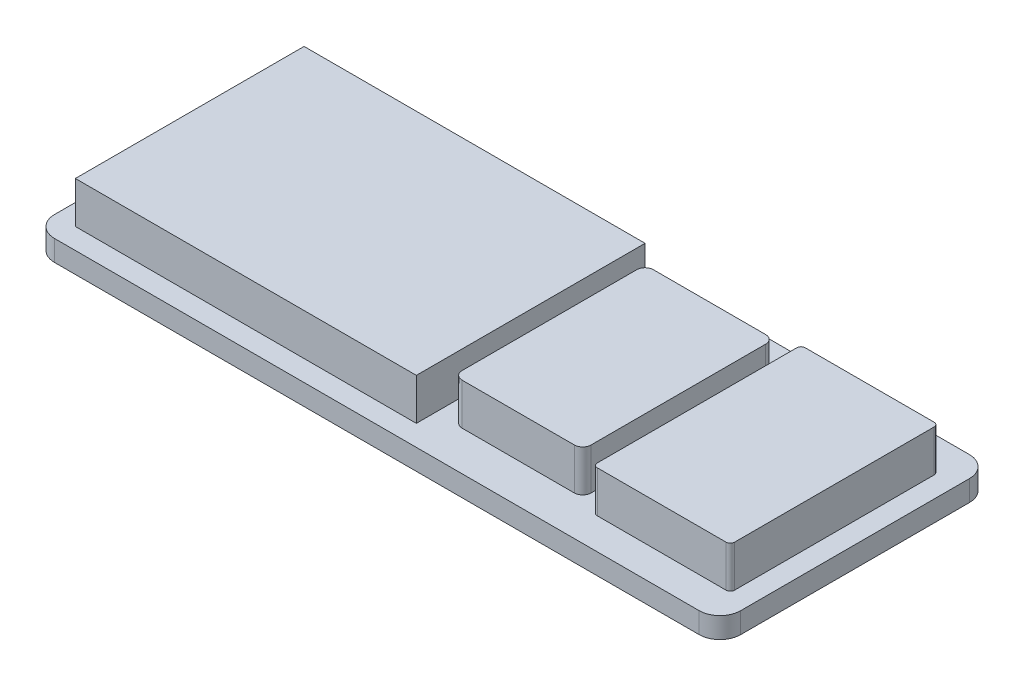
ISO-10303-21;
HEADER;
FILE_DESCRIPTION(('STEP AP214'),'2;1');
FILE_NAME('part.step','',(''),(''),'','','');
FILE_SCHEMA(('AUTOMOTIVE_DESIGN { 1 0 10303 214 1 1 1 1 }'));
ENDSEC;
DATA;
#1=APPLICATION_CONTEXT('core data for automotive mechanical design processes');
#2=APPLICATION_PROTOCOL_DEFINITION('international standard','automotive_design',2000,#1);
#3=PRODUCT_CONTEXT('',#1,'mechanical');
#4=PRODUCT('Part','Part','',(#3));
#5=PRODUCT_RELATED_PRODUCT_CATEGORY('part','',(#4));
#6=PRODUCT_DEFINITION_FORMATION('','',#4);
#7=PRODUCT_DEFINITION_CONTEXT('part definition',#1,'design');
#8=PRODUCT_DEFINITION('design','',#6,#7);
#9=PRODUCT_DEFINITION_SHAPE('','',#8);
#10=(LENGTH_UNIT() NAMED_UNIT(*) SI_UNIT(.MILLI.,.METRE.));
#11=(NAMED_UNIT(*) PLANE_ANGLE_UNIT() SI_UNIT($,.RADIAN.));
#12=(NAMED_UNIT(*) SI_UNIT($,.STERADIAN.) SOLID_ANGLE_UNIT());
#13=UNCERTAINTY_MEASURE_WITH_UNIT(LENGTH_MEASURE(1.E-05),#10,'distance_accuracy_value','');
#14=(GEOMETRIC_REPRESENTATION_CONTEXT(3) GLOBAL_UNCERTAINTY_ASSIGNED_CONTEXT((#13)) GLOBAL_UNIT_ASSIGNED_CONTEXT((#10,
#11,#12)) REPRESENTATION_CONTEXT('',''));
#15=CARTESIAN_POINT('',(0.,0.,0.));
#16=DIRECTION('',(0.,0.,1.));
#17=DIRECTION('',(1.,0.,0.));
#18=AXIS2_PLACEMENT_3D('',#15,#16,#17);
#19=CARTESIAN_POINT('',(0.,5.,0.));
#20=DIRECTION('',(0.,1.,0.));
#21=DIRECTION('',(0.,0.,1.));
#22=AXIS2_PLACEMENT_3D('',#19,#20,#21);
#23=PLANE('',#22);
#24=DIRECTION('',(1.,0.,0.));
#25=VECTOR('',#24,1.);
#26=CARTESIAN_POINT('',(26.4749340912451,5.,23.));
#27=LINE('',#26,#25);
#28=CARTESIAN_POINT('',(28.4749340912451,5.,23.));
#29=VERTEX_POINT('',#28);
#30=CARTESIAN_POINT('',(55.4749340912451,5.,23.));
#31=VERTEX_POINT('',#30);
#32=EDGE_CURVE('E403',#29,#31,#27,.T.);
#33=ORIENTED_EDGE('',*,*,#32,.F.);
#34=CARTESIAN_POINT('',(28.4749340912451,5.,21.));
#35=DIRECTION('',(0.,1.,0.));
#36=DIRECTION('',(0.,0.,1.));
#37=AXIS2_PLACEMENT_3D('',#34,#35,#36);
#38=CIRCLE('',#37,2.);
#39=CARTESIAN_POINT('',(26.4749340912451,5.,21.));
#40=VERTEX_POINT('',#39);
#41=EDGE_CURVE('E341',#29,#40,#38,.F.);
#42=ORIENTED_EDGE('',*,*,#41,.T.);
#43=DIRECTION('',(0.,0.,1.));
#44=VECTOR('',#43,1.);
#45=CARTESIAN_POINT('',(26.474934091245,5.,-23.));
#46=LINE('',#45,#44);
#47=CARTESIAN_POINT('',(26.474934091245,5.,-21.));
#48=VERTEX_POINT('',#47);
#49=EDGE_CURVE('E400',#48,#40,#46,.T.);
#50=ORIENTED_EDGE('',*,*,#49,.F.);
#51=CARTESIAN_POINT('',(28.474934091245,5.,-21.));
#52=DIRECTION('',(0.,1.,0.));
#53=DIRECTION('',(0.,0.,1.));
#54=AXIS2_PLACEMENT_3D('',#51,#52,#53);
#55=CIRCLE('',#54,2.);
#56=CARTESIAN_POINT('',(28.474934091245,5.,-23.));
#57=VERTEX_POINT('',#56);
#58=EDGE_CURVE('E335',#48,#57,#55,.F.);
#59=ORIENTED_EDGE('',*,*,#58,.T.);
#60=DIRECTION('',(-1.,0.,0.));
#61=VECTOR('',#60,1.);
#62=CARTESIAN_POINT('',(26.474934091245,5.,-23.));
#63=LINE('',#62,#61);
#64=CARTESIAN_POINT('',(55.474934091245,5.,-23.));
#65=VERTEX_POINT('',#64);
#66=EDGE_CURVE('E419',#65,#57,#63,.T.);
#67=ORIENTED_EDGE('',*,*,#66,.F.);
#68=CARTESIAN_POINT('',(55.474934091245,5.,-21.));
#69=DIRECTION('',(0.,1.,0.));
#70=DIRECTION('',(0.,0.,1.));
#71=AXIS2_PLACEMENT_3D('',#68,#69,#70);
#72=CIRCLE('',#71,2.);
#73=CARTESIAN_POINT('',(57.474934091245,5.,-21.));
#74=VERTEX_POINT('',#73);
#75=EDGE_CURVE('E337',#65,#74,#72,.F.);
#76=ORIENTED_EDGE('',*,*,#75,.T.);
#77=DIRECTION('',(0.,0.,-1.));
#78=VECTOR('',#77,1.);
#79=CARTESIAN_POINT('',(57.474934091245,5.,-23.));
#80=LINE('',#79,#78);
#81=CARTESIAN_POINT('',(57.4749340912451,5.,21.));
#82=VERTEX_POINT('',#81);
#83=EDGE_CURVE('E430',#82,#74,#80,.T.);
#84=ORIENTED_EDGE('',*,*,#83,.F.);
#85=CARTESIAN_POINT('',(55.4749340912451,5.,21.));
#86=DIRECTION('',(0.,1.,0.));
#87=DIRECTION('',(0.,0.,1.));
#88=AXIS2_PLACEMENT_3D('',#85,#86,#87);
#89=CIRCLE('',#88,2.);
#90=EDGE_CURVE('E339',#82,#31,#89,.F.);
#91=ORIENTED_EDGE('',*,*,#90,.T.);
#92=EDGE_LOOP('',(#33,#42,#50,#59,#67,#76,#84,#91));
#93=FACE_BOUND('',#92,.T.);
#94=DIRECTION('',(-1.,0.,0.));
#95=VECTOR('',#94,1.);
#96=CARTESIAN_POINT('',(-65.025065908755,5.,-32.5));
#97=LINE('',#96,#95);
#98=CARTESIAN_POINT('',(94.974934091245,5.,-32.5));
#99=VERTEX_POINT('',#98);
#100=CARTESIAN_POINT('',(-60.025065908755,5.,-32.5));
#101=VERTEX_POINT('',#100);
#102=EDGE_CURVE('E261',#99,#101,#97,.T.);
#103=ORIENTED_EDGE('',*,*,#102,.T.);
#104=CARTESIAN_POINT('',(-60.025065908755,5.,-27.5));
#105=DIRECTION('',(0.,1.,0.));
#106=DIRECTION('',(0.,0.,1.));
#107=AXIS2_PLACEMENT_3D('',#104,#105,#106);
#108=CIRCLE('',#107,5.);
#109=CARTESIAN_POINT('',(-65.025065908755,5.,-27.5));
#110=VERTEX_POINT('',#109);
#111=EDGE_CURVE('E295',#101,#110,#108,.T.);
#112=ORIENTED_EDGE('',*,*,#111,.T.);
#113=DIRECTION('',(0.,0.,1.));
#114=VECTOR('',#113,1.);
#115=CARTESIAN_POINT('',(-65.025065908755,5.,-32.5));
#116=LINE('',#115,#114);
#117=CARTESIAN_POINT('',(-65.0250659087549,5.,27.5));
#118=VERTEX_POINT('',#117);
#119=EDGE_CURVE('E251',#110,#118,#116,.T.);
#120=ORIENTED_EDGE('',*,*,#119,.T.);
#121=CARTESIAN_POINT('',(-60.0250659087549,5.,27.5));
#122=DIRECTION('',(0.,1.,0.));
#123=DIRECTION('',(0.,0.,1.));
#124=AXIS2_PLACEMENT_3D('',#121,#122,#123);
#125=CIRCLE('',#124,5.);
#126=CARTESIAN_POINT('',(-60.0250659087549,5.,32.5));
#127=VERTEX_POINT('',#126);
#128=EDGE_CURVE('E289',#118,#127,#125,.T.);
#129=ORIENTED_EDGE('',*,*,#128,.T.);
#130=DIRECTION('',(1.,0.,0.));
#131=VECTOR('',#130,1.);
#132=CARTESIAN_POINT('',(-65.0250659087549,5.,32.5));
#133=LINE('',#132,#131);
#134=CARTESIAN_POINT('',(94.974934091245,5.,32.5));
#135=VERTEX_POINT('',#134);
#136=EDGE_CURVE('E254',#127,#135,#133,.T.);
#137=ORIENTED_EDGE('',*,*,#136,.T.);
#138=CARTESIAN_POINT('',(94.974934091245,5.,27.5));
#139=DIRECTION('',(0.,1.,0.));
#140=DIRECTION('',(0.,0.,1.));
#141=AXIS2_PLACEMENT_3D('',#138,#139,#140);
#142=CIRCLE('',#141,5.);
#143=CARTESIAN_POINT('',(99.9749340912451,5.,27.5));
#144=VERTEX_POINT('',#143);
#145=EDGE_CURVE('E291',#135,#144,#142,.T.);
#146=ORIENTED_EDGE('',*,*,#145,.T.);
#147=DIRECTION('',(0.,0.,-1.));
#148=VECTOR('',#147,1.);
#149=CARTESIAN_POINT('',(99.9749340912451,5.,-32.5));
#150=LINE('',#149,#148);
#151=CARTESIAN_POINT('',(99.9749340912451,5.,-27.5));
#152=VERTEX_POINT('',#151);
#153=EDGE_CURVE('E258',#144,#152,#150,.T.);
#154=ORIENTED_EDGE('',*,*,#153,.T.);
#155=CARTESIAN_POINT('',(94.974934091245,5.,-27.5));
#156=DIRECTION('',(0.,1.,0.));
#157=DIRECTION('',(0.,0.,1.));
#158=AXIS2_PLACEMENT_3D('',#155,#156,#157);
#159=CIRCLE('',#158,5.);
#160=EDGE_CURVE('E293',#152,#99,#159,.T.);
#161=ORIENTED_EDGE('',*,*,#160,.T.);
#162=EDGE_LOOP('',(#103,#112,#120,#129,#137,#146,#154,#161));
#163=FACE_BOUND('',#162,.T.);
#164=DIRECTION('',(1.,0.,0.));
#165=VECTOR('',#164,1.);
#166=CARTESIAN_POINT('',(-60.025065908755,5.,27.5));
#167=LINE('',#166,#165);
#168=CARTESIAN_POINT('',(-60.025065908755,5.,27.5));
#169=VERTEX_POINT('',#168);
#170=CARTESIAN_POINT('',(21.9749340912451,5.,27.5));
#171=VERTEX_POINT('',#170);
#172=EDGE_CURVE('E439',#169,#171,#167,.T.);
#173=ORIENTED_EDGE('',*,*,#172,.F.);
#174=DIRECTION('',(0.,0.,1.));
#175=VECTOR('',#174,1.);
#176=CARTESIAN_POINT('',(-60.025065908755,5.,-27.5));
#177=LINE('',#176,#175);
#178=CARTESIAN_POINT('',(-60.025065908755,5.,-27.5));
#179=VERTEX_POINT('',#178);
#180=EDGE_CURVE('E240',#179,#169,#177,.T.);
#181=ORIENTED_EDGE('',*,*,#180,.F.);
#182=DIRECTION('',(-1.,0.,0.));
#183=VECTOR('',#182,1.);
#184=CARTESIAN_POINT('',(-60.025065908755,5.,-27.5));
#185=LINE('',#184,#183);
#186=CARTESIAN_POINT('',(21.974934091245,5.,-27.5));
#187=VERTEX_POINT('',#186);
#188=EDGE_CURVE('E236',#187,#179,#185,.T.);
#189=ORIENTED_EDGE('',*,*,#188,.F.);
#190=DIRECTION('',(0.,0.,-1.));
#191=VECTOR('',#190,1.);
#192=CARTESIAN_POINT('',(21.974934091245,5.,-27.5));
#193=LINE('',#192,#191);
#194=EDGE_CURVE('E441',#171,#187,#193,.T.);
#195=ORIENTED_EDGE('',*,*,#194,.F.);
#196=EDGE_LOOP('',(#173,#181,#189,#195));
#197=FACE_BOUND('',#196,.T.);
#198=DIRECTION('',(1.,0.,0.));
#199=VECTOR('',#198,1.);
#200=CARTESIAN_POINT('',(61.9749340912451,5.,25.));
#201=LINE('',#200,#199);
#202=CARTESIAN_POINT('',(62.974934091245,5.,25.));
#203=VERTEX_POINT('',#202);
#204=CARTESIAN_POINT('',(93.974934091245,5.,25.));
#205=VERTEX_POINT('',#204);
#206=EDGE_CURVE('E386',#203,#205,#201,.T.);
#207=ORIENTED_EDGE('',*,*,#206,.F.);
#208=CARTESIAN_POINT('',(62.974934091245,5.,24.));
#209=DIRECTION('',(0.,1.,0.));
#210=DIRECTION('',(0.,0.,1.));
#211=AXIS2_PLACEMENT_3D('',#208,#209,#210);
#212=CIRCLE('',#211,1.);
#213=CARTESIAN_POINT('',(61.9749340912451,5.,24.));
#214=VERTEX_POINT('',#213);
#215=EDGE_CURVE('E11',#203,#214,#212,.F.);
#216=ORIENTED_EDGE('',*,*,#215,.T.);
#217=DIRECTION('',(0.,0.,1.));
#218=VECTOR('',#217,1.);
#219=CARTESIAN_POINT('',(61.974934091245,5.,-25.));
#220=LINE('',#219,#218);
#221=CARTESIAN_POINT('',(61.974934091245,5.,-24.));
#222=VERTEX_POINT('',#221);
#223=EDGE_CURVE('E409',#222,#214,#220,.T.);
#224=ORIENTED_EDGE('',*,*,#223,.F.);
#225=CARTESIAN_POINT('',(62.974934091245,5.,-24.));
#226=DIRECTION('',(0.,1.,0.));
#227=DIRECTION('',(0.,0.,1.));
#228=AXIS2_PLACEMENT_3D('',#225,#226,#227);
#229=CIRCLE('',#228,1.);
#230=CARTESIAN_POINT('',(62.974934091245,5.,-25.));
#231=VERTEX_POINT('',#230);
#232=EDGE_CURVE('E370',#222,#231,#229,.F.);
#233=ORIENTED_EDGE('',*,*,#232,.T.);
#234=DIRECTION('',(-1.,0.,0.));
#235=VECTOR('',#234,1.);
#236=CARTESIAN_POINT('',(61.974934091245,5.,-25.));
#237=LINE('',#236,#235);
#238=CARTESIAN_POINT('',(93.974934091245,5.,-25.));
#239=VERTEX_POINT('',#238);
#240=EDGE_CURVE('E377',#239,#231,#237,.T.);
#241=ORIENTED_EDGE('',*,*,#240,.F.);
#242=CARTESIAN_POINT('',(93.974934091245,5.,-24.));
#243=DIRECTION('',(0.,1.,0.));
#244=DIRECTION('',(0.,0.,1.));
#245=AXIS2_PLACEMENT_3D('',#242,#243,#244);
#246=CIRCLE('',#245,1.);
#247=CARTESIAN_POINT('',(94.974934091245,5.,-24.));
#248=VERTEX_POINT('',#247);
#249=EDGE_CURVE('E372',#239,#248,#246,.F.);
#250=ORIENTED_EDGE('',*,*,#249,.T.);
#251=DIRECTION('',(0.,0.,-1.));
#252=VECTOR('',#251,1.);
#253=CARTESIAN_POINT('',(94.974934091245,5.,-25.));
#254=LINE('',#253,#252);
#255=CARTESIAN_POINT('',(94.974934091245,5.,24.));
#256=VERTEX_POINT('',#255);
#257=EDGE_CURVE('E375',#256,#248,#254,.T.);
#258=ORIENTED_EDGE('',*,*,#257,.F.);
#259=CARTESIAN_POINT('',(93.974934091245,5.,24.));
#260=DIRECTION('',(0.,1.,0.));
#261=DIRECTION('',(0.,0.,1.));
#262=AXIS2_PLACEMENT_3D('',#259,#260,#261);
#263=CIRCLE('',#262,1.);
#264=EDGE_CURVE('E41',#256,#205,#263,.F.);
#265=ORIENTED_EDGE('',*,*,#264,.T.);
#266=EDGE_LOOP('',(#207,#216,#224,#233,#241,#250,#258,#265));
#267=FACE_BOUND('',#266,.T.);
#268=ADVANCED_FACE('F33',(#93,#163,#197,#267),#23,.T.);
#269=CARTESIAN_POINT('',(-65.025065908755,5.,-32.5));
#270=DIRECTION('',(1.,0.,0.));
#271=DIRECTION('',(0.,0.,-1.));
#272=AXIS2_PLACEMENT_3D('',#269,#270,#271);
#273=PLANE('',#272);
#274=ORIENTED_EDGE('',*,*,#119,.F.);
#275=DIRECTION('',(0.,-1.,0.));
#276=VECTOR('',#275,1.);
#277=CARTESIAN_POINT('',(-65.025065908755,5.,-27.5));
#278=LINE('',#277,#276);
#279=CARTESIAN_POINT('',(-65.025065908755,0.,-27.5));
#280=VERTEX_POINT('',#279);
#281=EDGE_CURVE('E273',#110,#280,#278,.T.);
#282=ORIENTED_EDGE('',*,*,#281,.T.);
#283=DIRECTION('',(0.,0.,1.));
#284=VECTOR('',#283,1.);
#285=CARTESIAN_POINT('',(-65.025065908755,0.,-32.5));
#286=LINE('',#285,#284);
#287=CARTESIAN_POINT('',(-65.0250659087549,0.,27.5));
#288=VERTEX_POINT('',#287);
#289=EDGE_CURVE('E242',#280,#288,#286,.T.);
#290=ORIENTED_EDGE('',*,*,#289,.T.);
#291=DIRECTION('',(0.,-1.,0.));
#292=VECTOR('',#291,1.);
#293=CARTESIAN_POINT('',(-65.0250659087549,5.,27.5));
#294=LINE('',#293,#292);
#295=EDGE_CURVE('E263',#288,#118,#294,.F.);
#296=ORIENTED_EDGE('',*,*,#295,.T.);
#297=EDGE_LOOP('',(#274,#282,#290,#296));
#298=FACE_BOUND('',#297,.T.);
#299=ADVANCED_FACE('F454',(#298),#273,.F.);
#300=CARTESIAN_POINT('',(-65.0250659087549,5.,32.5));
#301=DIRECTION('',(0.,0.,-1.));
#302=DIRECTION('',(-1.,0.,0.));
#303=AXIS2_PLACEMENT_3D('',#300,#301,#302);
#304=PLANE('',#303);
#305=DIRECTION('',(1.,0.,0.));
#306=VECTOR('',#305,1.);
#307=CARTESIAN_POINT('',(-65.0250659087549,0.,32.5));
#308=LINE('',#307,#306);
#309=CARTESIAN_POINT('',(-60.0250659087549,0.,32.5));
#310=VERTEX_POINT('',#309);
#311=CARTESIAN_POINT('',(94.974934091245,0.,32.5));
#312=VERTEX_POINT('',#311);
#313=EDGE_CURVE('E245',#310,#312,#308,.T.);
#314=ORIENTED_EDGE('',*,*,#313,.T.);
#315=DIRECTION('',(0.,-1.,0.));
#316=VECTOR('',#315,1.);
#317=CARTESIAN_POINT('',(94.974934091245,5.,32.5));
#318=LINE('',#317,#316);
#319=EDGE_CURVE('E305',#312,#135,#318,.F.);
#320=ORIENTED_EDGE('',*,*,#319,.T.);
#321=ORIENTED_EDGE('',*,*,#136,.F.);
#322=DIRECTION('',(0.,-1.,0.));
#323=VECTOR('',#322,1.);
#324=CARTESIAN_POINT('',(-60.0250659087549,5.,32.5));
#325=LINE('',#324,#323);
#326=EDGE_CURVE('E302',#127,#310,#325,.T.);
#327=ORIENTED_EDGE('',*,*,#326,.T.);
#328=EDGE_LOOP('',(#314,#320,#321,#327));
#329=FACE_BOUND('',#328,.T.);
#330=ADVANCED_FACE('F462',(#329),#304,.F.);
#331=CARTESIAN_POINT('',(99.9749340912451,5.,-32.5));
#332=DIRECTION('',(-1.,0.,0.));
#333=DIRECTION('',(0.,0.,1.));
#334=AXIS2_PLACEMENT_3D('',#331,#332,#333);
#335=PLANE('',#334);
#336=DIRECTION('',(0.,0.,-1.));
#337=VECTOR('',#336,1.);
#338=CARTESIAN_POINT('',(99.9749340912451,0.,-32.5));
#339=LINE('',#338,#337);
#340=CARTESIAN_POINT('',(99.9749340912451,0.,27.5));
#341=VERTEX_POINT('',#340);
#342=CARTESIAN_POINT('',(99.9749340912451,0.,-27.5));
#343=VERTEX_POINT('',#342);
#344=EDGE_CURVE('E267',#341,#343,#339,.T.);
#345=ORIENTED_EDGE('',*,*,#344,.T.);
#346=DIRECTION('',(0.,-1.,0.));
#347=VECTOR('',#346,1.);
#348=CARTESIAN_POINT('',(99.9749340912451,5.,-27.5));
#349=LINE('',#348,#347);
#350=EDGE_CURVE('E300',#343,#152,#349,.F.);
#351=ORIENTED_EDGE('',*,*,#350,.T.);
#352=ORIENTED_EDGE('',*,*,#153,.F.);
#353=DIRECTION('',(0.,-1.,0.));
#354=VECTOR('',#353,1.);
#355=CARTESIAN_POINT('',(99.9749340912451,5.,27.5));
#356=LINE('',#355,#354);
#357=EDGE_CURVE('E297',#144,#341,#356,.T.);
#358=ORIENTED_EDGE('',*,*,#357,.T.);
#359=EDGE_LOOP('',(#345,#351,#352,#358));
#360=FACE_BOUND('',#359,.T.);
#361=ADVANCED_FACE('F478',(#360),#335,.F.);
#362=CARTESIAN_POINT('',(-65.025065908755,5.,-32.5));
#363=DIRECTION('',(0.,0.,1.));
#364=DIRECTION('',(1.,0.,0.));
#365=AXIS2_PLACEMENT_3D('',#362,#363,#364);
#366=PLANE('',#365);
#367=DIRECTION('',(-1.,0.,0.));
#368=VECTOR('',#367,1.);
#369=CARTESIAN_POINT('',(-65.025065908755,0.,-32.5));
#370=LINE('',#369,#368);
#371=CARTESIAN_POINT('',(94.974934091245,0.,-32.5));
#372=VERTEX_POINT('',#371);
#373=CARTESIAN_POINT('',(-60.025065908755,0.,-32.5));
#374=VERTEX_POINT('',#373);
#375=EDGE_CURVE('E255',#372,#374,#370,.T.);
#376=ORIENTED_EDGE('',*,*,#375,.T.);
#377=DIRECTION('',(0.,-1.,0.));
#378=VECTOR('',#377,1.);
#379=CARTESIAN_POINT('',(-60.025065908755,5.,-32.5));
#380=LINE('',#379,#378);
#381=EDGE_CURVE('E287',#374,#101,#380,.F.);
#382=ORIENTED_EDGE('',*,*,#381,.T.);
#383=ORIENTED_EDGE('',*,*,#102,.F.);
#384=DIRECTION('',(0.,-1.,0.));
#385=VECTOR('',#384,1.);
#386=CARTESIAN_POINT('',(94.974934091245,5.,-32.5));
#387=LINE('',#386,#385);
#388=EDGE_CURVE('E284',#99,#372,#387,.T.);
#389=ORIENTED_EDGE('',*,*,#388,.T.);
#390=EDGE_LOOP('',(#376,#382,#383,#389));
#391=FACE_BOUND('',#390,.T.);
#392=ADVANCED_FACE('F474',(#391),#366,.F.);
#393=CARTESIAN_POINT('',(0.,0.,0.));
#394=DIRECTION('',(0.,1.,0.));
#395=DIRECTION('',(0.,0.,1.));
#396=AXIS2_PLACEMENT_3D('',#393,#394,#395);
#397=PLANE('',#396);
#398=ORIENTED_EDGE('',*,*,#289,.F.);
#399=CARTESIAN_POINT('',(-60.025065908755,0.,-27.5));
#400=DIRECTION('',(0.,1.,0.));
#401=DIRECTION('',(0.,0.,1.));
#402=AXIS2_PLACEMENT_3D('',#399,#400,#401);
#403=CIRCLE('',#402,5.);
#404=EDGE_CURVE('E282',#280,#374,#403,.F.);
#405=ORIENTED_EDGE('',*,*,#404,.T.);
#406=ORIENTED_EDGE('',*,*,#375,.F.);
#407=CARTESIAN_POINT('',(94.974934091245,0.,-27.5));
#408=DIRECTION('',(0.,1.,0.));
#409=DIRECTION('',(0.,0.,1.));
#410=AXIS2_PLACEMENT_3D('',#407,#408,#409);
#411=CIRCLE('',#410,5.);
#412=EDGE_CURVE('E280',#372,#343,#411,.F.);
#413=ORIENTED_EDGE('',*,*,#412,.T.);
#414=ORIENTED_EDGE('',*,*,#344,.F.);
#415=CARTESIAN_POINT('',(94.974934091245,0.,27.5));
#416=DIRECTION('',(0.,1.,0.));
#417=DIRECTION('',(0.,0.,1.));
#418=AXIS2_PLACEMENT_3D('',#415,#416,#417);
#419=CIRCLE('',#418,5.);
#420=EDGE_CURVE('E278',#341,#312,#419,.F.);
#421=ORIENTED_EDGE('',*,*,#420,.T.);
#422=ORIENTED_EDGE('',*,*,#313,.F.);
#423=CARTESIAN_POINT('',(-60.0250659087549,0.,27.5));
#424=DIRECTION('',(0.,1.,0.));
#425=DIRECTION('',(0.,0.,1.));
#426=AXIS2_PLACEMENT_3D('',#423,#424,#425);
#427=CIRCLE('',#426,5.);
#428=EDGE_CURVE('E276',#310,#288,#427,.F.);
#429=ORIENTED_EDGE('',*,*,#428,.T.);
#430=EDGE_LOOP('',(#398,#405,#406,#413,#414,#421,#422,#429));
#431=FACE_BOUND('',#430,.T.);
#432=ADVANCED_FACE('F470',(#431),#397,.F.);
#433=CARTESIAN_POINT('',(-60.025065908755,5.,-27.5));
#434=DIRECTION('',(0.,-1.,0.));
#435=DIRECTION('',(0.,0.,-1.));
#436=AXIS2_PLACEMENT_3D('',#433,#434,#435);
#437=CYLINDRICAL_SURFACE('',#436,5.);
#438=ORIENTED_EDGE('',*,*,#111,.F.);
#439=ORIENTED_EDGE('',*,*,#381,.F.);
#440=ORIENTED_EDGE('',*,*,#404,.F.);
#441=ORIENTED_EDGE('',*,*,#281,.F.);
#442=EDGE_LOOP('',(#438,#439,#440,#441));
#443=FACE_BOUND('',#442,.T.);
#444=ADVANCED_FACE('F473',(#443),#437,.T.);
#445=CARTESIAN_POINT('',(94.974934091245,5.,-27.5));
#446=DIRECTION('',(0.,-1.,0.));
#447=DIRECTION('',(0.,0.,-1.));
#448=AXIS2_PLACEMENT_3D('',#445,#446,#447);
#449=CYLINDRICAL_SURFACE('',#448,5.);
#450=ORIENTED_EDGE('',*,*,#160,.F.);
#451=ORIENTED_EDGE('',*,*,#350,.F.);
#452=ORIENTED_EDGE('',*,*,#412,.F.);
#453=ORIENTED_EDGE('',*,*,#388,.F.);
#454=EDGE_LOOP('',(#450,#451,#452,#453));
#455=FACE_BOUND('',#454,.T.);
#456=ADVANCED_FACE('F488',(#455),#449,.T.);
#457=CARTESIAN_POINT('',(94.974934091245,5.,27.5));
#458=DIRECTION('',(0.,-1.,0.));
#459=DIRECTION('',(0.,0.,-1.));
#460=AXIS2_PLACEMENT_3D('',#457,#458,#459);
#461=CYLINDRICAL_SURFACE('',#460,5.);
#462=ORIENTED_EDGE('',*,*,#145,.F.);
#463=ORIENTED_EDGE('',*,*,#319,.F.);
#464=ORIENTED_EDGE('',*,*,#420,.F.);
#465=ORIENTED_EDGE('',*,*,#357,.F.);
#466=EDGE_LOOP('',(#462,#463,#464,#465));
#467=FACE_BOUND('',#466,.T.);
#468=ADVANCED_FACE('F492',(#467),#461,.T.);
#469=CARTESIAN_POINT('',(-60.0250659087549,5.,27.5));
#470=DIRECTION('',(0.,-1.,0.));
#471=DIRECTION('',(0.,0.,-1.));
#472=AXIS2_PLACEMENT_3D('',#469,#470,#471);
#473=CYLINDRICAL_SURFACE('',#472,5.);
#474=ORIENTED_EDGE('',*,*,#128,.F.);
#475=ORIENTED_EDGE('',*,*,#295,.F.);
#476=ORIENTED_EDGE('',*,*,#428,.F.);
#477=ORIENTED_EDGE('',*,*,#326,.F.);
#478=EDGE_LOOP('',(#474,#475,#476,#477));
#479=FACE_BOUND('',#478,.T.);
#480=ADVANCED_FACE('F496',(#479),#473,.T.);
#481=CARTESIAN_POINT('',(-60.025065908755,15.,-27.5));
#482=DIRECTION('',(1.,0.,0.));
#483=DIRECTION('',(0.,0.,-1.));
#484=AXIS2_PLACEMENT_3D('',#481,#482,#483);
#485=PLANE('',#484);
#486=ORIENTED_EDGE('',*,*,#180,.T.);
#487=DIRECTION('',(0.,-1.,0.));
#488=VECTOR('',#487,1.);
#489=CARTESIAN_POINT('',(-60.025065908755,15.,27.5));
#490=LINE('',#489,#488);
#491=CARTESIAN_POINT('',(-60.025065908755,15.,27.5));
#492=VERTEX_POINT('',#491);
#493=EDGE_CURVE('E220',#492,#169,#490,.T.);
#494=ORIENTED_EDGE('',*,*,#493,.F.);
#495=DIRECTION('',(0.,0.,1.));
#496=VECTOR('',#495,1.);
#497=CARTESIAN_POINT('',(-60.025065908755,15.,-27.5));
#498=LINE('',#497,#496);
#499=CARTESIAN_POINT('',(-60.025065908755,15.,-27.5));
#500=VERTEX_POINT('',#499);
#501=EDGE_CURVE('E227',#500,#492,#498,.T.);
#502=ORIENTED_EDGE('',*,*,#501,.F.);
#503=DIRECTION('',(0.,-1.,0.));
#504=VECTOR('',#503,1.);
#505=CARTESIAN_POINT('',(-60.025065908755,15.,-27.5));
#506=LINE('',#505,#504);
#507=EDGE_CURVE('E437',#500,#179,#506,.T.);
#508=ORIENTED_EDGE('',*,*,#507,.T.);
#509=EDGE_LOOP('',(#486,#494,#502,#508));
#510=FACE_BOUND('',#509,.T.);
#511=ADVANCED_FACE('F238',(#510),#485,.F.);
#512=CARTESIAN_POINT('',(-60.025065908755,15.,27.5));
#513=DIRECTION('',(0.,0.,-1.));
#514=DIRECTION('',(-1.,0.,0.));
#515=AXIS2_PLACEMENT_3D('',#512,#513,#514);
#516=PLANE('',#515);
#517=ORIENTED_EDGE('',*,*,#172,.T.);
#518=DIRECTION('',(0.,-1.,0.));
#519=VECTOR('',#518,1.);
#520=CARTESIAN_POINT('',(21.9749340912451,15.,27.5));
#521=LINE('',#520,#519);
#522=CARTESIAN_POINT('',(21.9749340912451,15.,27.5));
#523=VERTEX_POINT('',#522);
#524=EDGE_CURVE('E223',#523,#171,#521,.T.);
#525=ORIENTED_EDGE('',*,*,#524,.F.);
#526=DIRECTION('',(1.,0.,0.));
#527=VECTOR('',#526,1.);
#528=CARTESIAN_POINT('',(-60.025065908755,15.,27.5));
#529=LINE('',#528,#527);
#530=EDGE_CURVE('E216',#492,#523,#529,.T.);
#531=ORIENTED_EDGE('',*,*,#530,.F.);
#532=ORIENTED_EDGE('',*,*,#493,.T.);
#533=EDGE_LOOP('',(#517,#525,#531,#532));
#534=FACE_BOUND('',#533,.T.);
#535=ADVANCED_FACE('F218',(#534),#516,.F.);
#536=CARTESIAN_POINT('',(21.974934091245,15.,-27.5));
#537=DIRECTION('',(-1.,0.,0.));
#538=DIRECTION('',(0.,0.,1.));
#539=AXIS2_PLACEMENT_3D('',#536,#537,#538);
#540=PLANE('',#539);
#541=ORIENTED_EDGE('',*,*,#194,.T.);
#542=DIRECTION('',(0.,-1.,0.));
#543=VECTOR('',#542,1.);
#544=CARTESIAN_POINT('',(21.974934091245,15.,-27.5));
#545=LINE('',#544,#543);
#546=CARTESIAN_POINT('',(21.974934091245,15.,-27.5));
#547=VERTEX_POINT('',#546);
#548=EDGE_CURVE('E247',#547,#187,#545,.T.);
#549=ORIENTED_EDGE('',*,*,#548,.F.);
#550=DIRECTION('',(0.,0.,-1.));
#551=VECTOR('',#550,1.);
#552=CARTESIAN_POINT('',(21.974934091245,15.,-27.5));
#553=LINE('',#552,#551);
#554=EDGE_CURVE('E226',#523,#547,#553,.T.);
#555=ORIENTED_EDGE('',*,*,#554,.F.);
#556=ORIENTED_EDGE('',*,*,#524,.T.);
#557=EDGE_LOOP('',(#541,#549,#555,#556));
#558=FACE_BOUND('',#557,.T.);
#559=ADVANCED_FACE('F451',(#558),#540,.F.);
#560=CARTESIAN_POINT('',(-60.025065908755,15.,-27.5));
#561=DIRECTION('',(0.,0.,1.));
#562=DIRECTION('',(1.,0.,0.));
#563=AXIS2_PLACEMENT_3D('',#560,#561,#562);
#564=PLANE('',#563);
#565=ORIENTED_EDGE('',*,*,#188,.T.);
#566=ORIENTED_EDGE('',*,*,#507,.F.);
#567=DIRECTION('',(-1.,0.,0.));
#568=VECTOR('',#567,1.);
#569=CARTESIAN_POINT('',(-60.025065908755,15.,-27.5));
#570=LINE('',#569,#568);
#571=EDGE_CURVE('E232',#547,#500,#570,.T.);
#572=ORIENTED_EDGE('',*,*,#571,.F.);
#573=ORIENTED_EDGE('',*,*,#548,.T.);
#574=EDGE_LOOP('',(#565,#566,#572,#573));
#575=FACE_BOUND('',#574,.T.);
#576=ADVANCED_FACE('F447',(#575),#564,.F.);
#577=CARTESIAN_POINT('',(0.,15.,0.));
#578=DIRECTION('',(0.,1.,0.));
#579=DIRECTION('',(0.,0.,1.));
#580=AXIS2_PLACEMENT_3D('',#577,#578,#579);
#581=PLANE('',#580);
#582=ORIENTED_EDGE('',*,*,#501,.T.);
#583=ORIENTED_EDGE('',*,*,#530,.T.);
#584=ORIENTED_EDGE('',*,*,#554,.T.);
#585=ORIENTED_EDGE('',*,*,#571,.T.);
#586=EDGE_LOOP('',(#582,#583,#584,#585));
#587=FACE_BOUND('',#586,.T.);
#588=ADVANCED_FACE('F230',(#587),#581,.T.);
#589=CARTESIAN_POINT('',(26.474934091245,15.,-23.));
#590=DIRECTION('',(1.,0.,0.));
#591=DIRECTION('',(0.,0.,-1.));
#592=AXIS2_PLACEMENT_3D('',#589,#590,#591);
#593=PLANE('',#592);
#594=DIRECTION('',(0.,0.,1.));
#595=VECTOR('',#594,1.);
#596=CARTESIAN_POINT('',(26.474934091245,15.,-23.));
#597=LINE('',#596,#595);
#598=CARTESIAN_POINT('',(26.474934091245,15.,-21.));
#599=VERTEX_POINT('',#598);
#600=CARTESIAN_POINT('',(26.4749340912451,15.,21.));
#601=VERTEX_POINT('',#600);
#602=EDGE_CURVE('E415',#599,#601,#597,.T.);
#603=ORIENTED_EDGE('',*,*,#602,.F.);
#604=DIRECTION('',(0.,-1.,0.));
#605=VECTOR('',#604,1.);
#606=CARTESIAN_POINT('',(26.474934091245,15.,-21.));
#607=LINE('',#606,#605);
#608=EDGE_CURVE('E309',#599,#48,#607,.T.);
#609=ORIENTED_EDGE('',*,*,#608,.T.);
#610=ORIENTED_EDGE('',*,*,#49,.T.);
#611=DIRECTION('',(0.,-1.,0.));
#612=VECTOR('',#611,1.);
#613=CARTESIAN_POINT('',(26.4749340912451,15.,21.));
#614=LINE('',#613,#612);
#615=EDGE_CURVE('E307',#40,#601,#614,.F.);
#616=ORIENTED_EDGE('',*,*,#615,.T.);
#617=EDGE_LOOP('',(#603,#609,#610,#616));
#618=FACE_BOUND('',#617,.T.);
#619=ADVANCED_FACE('F564',(#618),#593,.F.);
#620=CARTESIAN_POINT('',(26.4749340912451,15.,23.));
#621=DIRECTION('',(0.,0.,-1.));
#622=DIRECTION('',(-1.,0.,0.));
#623=AXIS2_PLACEMENT_3D('',#620,#621,#622);
#624=PLANE('',#623);
#625=ORIENTED_EDGE('',*,*,#32,.T.);
#626=DIRECTION('',(0.,-1.,0.));
#627=VECTOR('',#626,1.);
#628=CARTESIAN_POINT('',(55.4749340912451,15.,23.));
#629=LINE('',#628,#627);
#630=CARTESIAN_POINT('',(55.4749340912451,15.,23.));
#631=VERTEX_POINT('',#630);
#632=EDGE_CURVE('E333',#31,#631,#629,.F.);
#633=ORIENTED_EDGE('',*,*,#632,.T.);
#634=DIRECTION('',(1.,0.,0.));
#635=VECTOR('',#634,1.);
#636=CARTESIAN_POINT('',(26.4749340912451,15.,23.));
#637=LINE('',#636,#635);
#638=CARTESIAN_POINT('',(28.4749340912451,15.,23.));
#639=VERTEX_POINT('',#638);
#640=EDGE_CURVE('E418',#639,#631,#637,.T.);
#641=ORIENTED_EDGE('',*,*,#640,.F.);
#642=DIRECTION('',(0.,-1.,0.));
#643=VECTOR('',#642,1.);
#644=CARTESIAN_POINT('',(28.4749340912451,15.,23.));
#645=LINE('',#644,#643);
#646=EDGE_CURVE('E330',#639,#29,#645,.T.);
#647=ORIENTED_EDGE('',*,*,#646,.T.);
#648=EDGE_LOOP('',(#625,#633,#641,#647));
#649=FACE_BOUND('',#648,.T.);
#650=ADVANCED_FACE('F560',(#649),#624,.F.);
#651=CARTESIAN_POINT('',(57.474934091245,15.,-23.));
#652=DIRECTION('',(-1.,0.,0.));
#653=DIRECTION('',(0.,0.,1.));
#654=AXIS2_PLACEMENT_3D('',#651,#652,#653);
#655=PLANE('',#654);
#656=ORIENTED_EDGE('',*,*,#83,.T.);
#657=DIRECTION('',(0.,-1.,0.));
#658=VECTOR('',#657,1.);
#659=CARTESIAN_POINT('',(57.474934091245,15.,-21.));
#660=LINE('',#659,#658);
#661=CARTESIAN_POINT('',(57.474934091245,15.,-21.));
#662=VERTEX_POINT('',#661);
#663=EDGE_CURVE('E328',#74,#662,#660,.F.);
#664=ORIENTED_EDGE('',*,*,#663,.T.);
#665=DIRECTION('',(0.,0.,-1.));
#666=VECTOR('',#665,1.);
#667=CARTESIAN_POINT('',(57.474934091245,15.,-23.));
#668=LINE('',#667,#666);
#669=CARTESIAN_POINT('',(57.4749340912451,15.,21.));
#670=VERTEX_POINT('',#669);
#671=EDGE_CURVE('E422',#670,#662,#668,.T.);
#672=ORIENTED_EDGE('',*,*,#671,.F.);
#673=DIRECTION('',(0.,-1.,0.));
#674=VECTOR('',#673,1.);
#675=CARTESIAN_POINT('',(57.4749340912451,15.,21.));
#676=LINE('',#675,#674);
#677=EDGE_CURVE('E325',#670,#82,#676,.T.);
#678=ORIENTED_EDGE('',*,*,#677,.T.);
#679=EDGE_LOOP('',(#656,#664,#672,#678));
#680=FACE_BOUND('',#679,.T.);
#681=ADVANCED_FACE('F556',(#680),#655,.F.);
#682=CARTESIAN_POINT('',(26.474934091245,15.,-23.));
#683=DIRECTION('',(0.,0.,1.));
#684=DIRECTION('',(1.,0.,0.));
#685=AXIS2_PLACEMENT_3D('',#682,#683,#684);
#686=PLANE('',#685);
#687=ORIENTED_EDGE('',*,*,#66,.T.);
#688=DIRECTION('',(0.,-1.,0.));
#689=VECTOR('',#688,1.);
#690=CARTESIAN_POINT('',(28.474934091245,15.,-23.));
#691=LINE('',#690,#689);
#692=CARTESIAN_POINT('',(28.474934091245,15.,-23.));
#693=VERTEX_POINT('',#692);
#694=EDGE_CURVE('E315',#57,#693,#691,.F.);
#695=ORIENTED_EDGE('',*,*,#694,.T.);
#696=DIRECTION('',(-1.,0.,0.));
#697=VECTOR('',#696,1.);
#698=CARTESIAN_POINT('',(26.474934091245,15.,-23.));
#699=LINE('',#698,#697);
#700=CARTESIAN_POINT('',(55.474934091245,15.,-23.));
#701=VERTEX_POINT('',#700);
#702=EDGE_CURVE('E425',#701,#693,#699,.T.);
#703=ORIENTED_EDGE('',*,*,#702,.F.);
#704=DIRECTION('',(0.,-1.,0.));
#705=VECTOR('',#704,1.);
#706=CARTESIAN_POINT('',(55.474934091245,15.,-23.));
#707=LINE('',#706,#705);
#708=EDGE_CURVE('E312',#701,#65,#707,.T.);
#709=ORIENTED_EDGE('',*,*,#708,.T.);
#710=EDGE_LOOP('',(#687,#695,#703,#709));
#711=FACE_BOUND('',#710,.T.);
#712=ADVANCED_FACE('F549',(#711),#686,.F.);
#713=CARTESIAN_POINT('',(0.,15.,0.));
#714=DIRECTION('',(0.,1.,0.));
#715=DIRECTION('',(0.,0.,1.));
#716=AXIS2_PLACEMENT_3D('',#713,#714,#715);
#717=PLANE('',#716);
#718=ORIENTED_EDGE('',*,*,#702,.T.);
#719=CARTESIAN_POINT('',(28.474934091245,15.,-21.));
#720=DIRECTION('',(0.,1.,0.));
#721=DIRECTION('',(0.,0.,1.));
#722=AXIS2_PLACEMENT_3D('',#719,#720,#721);
#723=CIRCLE('',#722,2.);
#724=EDGE_CURVE('E323',#693,#599,#723,.T.);
#725=ORIENTED_EDGE('',*,*,#724,.T.);
#726=ORIENTED_EDGE('',*,*,#602,.T.);
#727=CARTESIAN_POINT('',(28.4749340912451,15.,21.));
#728=DIRECTION('',(0.,1.,0.));
#729=DIRECTION('',(0.,0.,1.));
#730=AXIS2_PLACEMENT_3D('',#727,#728,#729);
#731=CIRCLE('',#730,2.);
#732=EDGE_CURVE('E317',#601,#639,#731,.T.);
#733=ORIENTED_EDGE('',*,*,#732,.T.);
#734=ORIENTED_EDGE('',*,*,#640,.T.);
#735=CARTESIAN_POINT('',(55.4749340912451,15.,21.));
#736=DIRECTION('',(0.,1.,0.));
#737=DIRECTION('',(0.,0.,1.));
#738=AXIS2_PLACEMENT_3D('',#735,#736,#737);
#739=CIRCLE('',#738,2.);
#740=EDGE_CURVE('E319',#631,#670,#739,.T.);
#741=ORIENTED_EDGE('',*,*,#740,.T.);
#742=ORIENTED_EDGE('',*,*,#671,.T.);
#743=CARTESIAN_POINT('',(55.474934091245,15.,-21.));
#744=DIRECTION('',(0.,1.,0.));
#745=DIRECTION('',(0.,0.,1.));
#746=AXIS2_PLACEMENT_3D('',#743,#744,#745);
#747=CIRCLE('',#746,2.);
#748=EDGE_CURVE('E321',#662,#701,#747,.T.);
#749=ORIENTED_EDGE('',*,*,#748,.T.);
#750=EDGE_LOOP('',(#718,#725,#726,#733,#734,#741,#742,#749));
#751=FACE_BOUND('',#750,.T.);
#752=ADVANCED_FACE('F542',(#751),#717,.T.);
#753=CARTESIAN_POINT('',(61.974934091245,15.,-25.));
#754=DIRECTION('',(1.,0.,0.));
#755=DIRECTION('',(0.,0.,-1.));
#756=AXIS2_PLACEMENT_3D('',#753,#754,#755);
#757=PLANE('',#756);
#758=DIRECTION('',(0.,0.,1.));
#759=VECTOR('',#758,1.);
#760=CARTESIAN_POINT('',(61.974934091245,15.,-25.));
#761=LINE('',#760,#759);
#762=CARTESIAN_POINT('',(61.974934091245,15.,-24.));
#763=VERTEX_POINT('',#762);
#764=CARTESIAN_POINT('',(61.9749340912451,15.,24.));
#765=VERTEX_POINT('',#764);
#766=EDGE_CURVE('E414',#763,#765,#761,.T.);
#767=ORIENTED_EDGE('',*,*,#766,.F.);
#768=DIRECTION('',(0.,-1.,0.));
#769=VECTOR('',#768,1.);
#770=CARTESIAN_POINT('',(61.974934091245,15.,-24.));
#771=LINE('',#770,#769);
#772=EDGE_CURVE('E345',#763,#222,#771,.T.);
#773=ORIENTED_EDGE('',*,*,#772,.T.);
#774=ORIENTED_EDGE('',*,*,#223,.T.);
#775=DIRECTION('',(0.,-1.,0.));
#776=VECTOR('',#775,1.);
#777=CARTESIAN_POINT('',(61.9749340912451,15.,24.));
#778=LINE('',#777,#776);
#779=EDGE_CURVE('E343',#214,#765,#778,.F.);
#780=ORIENTED_EDGE('',*,*,#779,.T.);
#781=EDGE_LOOP('',(#767,#773,#774,#780));
#782=FACE_BOUND('',#781,.T.);
#783=ADVANCED_FACE('F541',(#782),#757,.F.);
#784=CARTESIAN_POINT('',(61.9749340912451,15.,25.));
#785=DIRECTION('',(0.,0.,-1.));
#786=DIRECTION('',(-1.,0.,0.));
#787=AXIS2_PLACEMENT_3D('',#784,#785,#786);
#788=PLANE('',#787);
#789=ORIENTED_EDGE('',*,*,#206,.T.);
#790=DIRECTION('',(0.,-1.,0.));
#791=VECTOR('',#790,1.);
#792=CARTESIAN_POINT('',(93.974934091245,15.,25.));
#793=LINE('',#792,#791);
#794=CARTESIAN_POINT('',(93.974934091245,15.,25.));
#795=VERTEX_POINT('',#794);
#796=EDGE_CURVE('E368',#205,#795,#793,.F.);
#797=ORIENTED_EDGE('',*,*,#796,.T.);
#798=DIRECTION('',(1.,0.,0.));
#799=VECTOR('',#798,1.);
#800=CARTESIAN_POINT('',(61.9749340912451,15.,25.));
#801=LINE('',#800,#799);
#802=CARTESIAN_POINT('',(62.974934091245,15.,25.));
#803=VERTEX_POINT('',#802);
#804=EDGE_CURVE('E405',#803,#795,#801,.T.);
#805=ORIENTED_EDGE('',*,*,#804,.F.);
#806=DIRECTION('',(0.,-1.,0.));
#807=VECTOR('',#806,1.);
#808=CARTESIAN_POINT('',(62.974934091245,15.,25.));
#809=LINE('',#808,#807);
#810=EDGE_CURVE('E366',#803,#203,#809,.T.);
#811=ORIENTED_EDGE('',*,*,#810,.T.);
#812=EDGE_LOOP('',(#789,#797,#805,#811));
#813=FACE_BOUND('',#812,.T.);
#814=ADVANCED_FACE('F539',(#813),#788,.F.);
#815=CARTESIAN_POINT('',(94.974934091245,15.,-25.));
#816=DIRECTION('',(-1.,0.,0.));
#817=DIRECTION('',(0.,0.,1.));
#818=AXIS2_PLACEMENT_3D('',#815,#816,#817);
#819=PLANE('',#818);
#820=ORIENTED_EDGE('',*,*,#257,.T.);
#821=DIRECTION('',(0.,-1.,0.));
#822=VECTOR('',#821,1.);
#823=CARTESIAN_POINT('',(94.974934091245,15.,-24.));
#824=LINE('',#823,#822);
#825=CARTESIAN_POINT('',(94.974934091245,15.,-24.));
#826=VERTEX_POINT('',#825);
#827=EDGE_CURVE('E364',#248,#826,#824,.F.);
#828=ORIENTED_EDGE('',*,*,#827,.T.);
#829=DIRECTION('',(0.,0.,-1.));
#830=VECTOR('',#829,1.);
#831=CARTESIAN_POINT('',(94.974934091245,15.,-25.));
#832=LINE('',#831,#830);
#833=CARTESIAN_POINT('',(94.974934091245,15.,24.));
#834=VERTEX_POINT('',#833);
#835=EDGE_CURVE('E396',#834,#826,#832,.T.);
#836=ORIENTED_EDGE('',*,*,#835,.F.);
#837=DIRECTION('',(0.,-1.,0.));
#838=VECTOR('',#837,1.);
#839=CARTESIAN_POINT('',(94.974934091245,15.,24.));
#840=LINE('',#839,#838);
#841=EDGE_CURVE('E361',#834,#256,#840,.T.);
#842=ORIENTED_EDGE('',*,*,#841,.T.);
#843=EDGE_LOOP('',(#820,#828,#836,#842));
#844=FACE_BOUND('',#843,.T.);
#845=ADVANCED_FACE('F382',(#844),#819,.F.);
#846=CARTESIAN_POINT('',(61.974934091245,15.,-25.));
#847=DIRECTION('',(0.,0.,1.));
#848=DIRECTION('',(1.,0.,0.));
#849=AXIS2_PLACEMENT_3D('',#846,#847,#848);
#850=PLANE('',#849);
#851=ORIENTED_EDGE('',*,*,#240,.T.);
#852=DIRECTION('',(0.,-1.,0.));
#853=VECTOR('',#852,1.);
#854=CARTESIAN_POINT('',(62.974934091245,15.,-25.));
#855=LINE('',#854,#853);
#856=CARTESIAN_POINT('',(62.974934091245,15.,-25.));
#857=VERTEX_POINT('',#856);
#858=EDGE_CURVE('E351',#231,#857,#855,.F.);
#859=ORIENTED_EDGE('',*,*,#858,.T.);
#860=DIRECTION('',(-1.,0.,0.));
#861=VECTOR('',#860,1.);
#862=CARTESIAN_POINT('',(61.974934091245,15.,-25.));
#863=LINE('',#862,#861);
#864=CARTESIAN_POINT('',(93.974934091245,15.,-25.));
#865=VERTEX_POINT('',#864);
#866=EDGE_CURVE('E394',#865,#857,#863,.T.);
#867=ORIENTED_EDGE('',*,*,#866,.F.);
#868=DIRECTION('',(0.,-1.,0.));
#869=VECTOR('',#868,1.);
#870=CARTESIAN_POINT('',(93.974934091245,15.,-25.));
#871=LINE('',#870,#869);
#872=EDGE_CURVE('E348',#865,#239,#871,.T.);
#873=ORIENTED_EDGE('',*,*,#872,.T.);
#874=EDGE_LOOP('',(#851,#859,#867,#873));
#875=FACE_BOUND('',#874,.T.);
#876=ADVANCED_FACE('F398',(#875),#850,.F.);
#877=CARTESIAN_POINT('',(0.,15.,0.));
#878=DIRECTION('',(0.,1.,0.));
#879=DIRECTION('',(0.,0.,1.));
#880=AXIS2_PLACEMENT_3D('',#877,#878,#879);
#881=PLANE('',#880);
#882=ORIENTED_EDGE('',*,*,#866,.T.);
#883=CARTESIAN_POINT('',(62.974934091245,15.,-24.));
#884=DIRECTION('',(0.,1.,0.));
#885=DIRECTION('',(0.,0.,1.));
#886=AXIS2_PLACEMENT_3D('',#883,#884,#885);
#887=CIRCLE('',#886,1.);
#888=EDGE_CURVE('E359',#857,#763,#887,.T.);
#889=ORIENTED_EDGE('',*,*,#888,.T.);
#890=ORIENTED_EDGE('',*,*,#766,.T.);
#891=CARTESIAN_POINT('',(62.974934091245,15.,24.));
#892=DIRECTION('',(0.,1.,0.));
#893=DIRECTION('',(0.,0.,1.));
#894=AXIS2_PLACEMENT_3D('',#891,#892,#893);
#895=CIRCLE('',#894,1.);
#896=EDGE_CURVE('E353',#765,#803,#895,.T.);
#897=ORIENTED_EDGE('',*,*,#896,.T.);
#898=ORIENTED_EDGE('',*,*,#804,.T.);
#899=CARTESIAN_POINT('',(93.974934091245,15.,24.));
#900=DIRECTION('',(0.,1.,0.));
#901=DIRECTION('',(0.,0.,1.));
#902=AXIS2_PLACEMENT_3D('',#899,#900,#901);
#903=CIRCLE('',#902,1.);
#904=EDGE_CURVE('E355',#795,#834,#903,.T.);
#905=ORIENTED_EDGE('',*,*,#904,.T.);
#906=ORIENTED_EDGE('',*,*,#835,.T.);
#907=CARTESIAN_POINT('',(93.974934091245,15.,-24.));
#908=DIRECTION('',(0.,1.,0.));
#909=DIRECTION('',(0.,0.,1.));
#910=AXIS2_PLACEMENT_3D('',#907,#908,#909);
#911=CIRCLE('',#910,1.);
#912=EDGE_CURVE('E357',#826,#865,#911,.T.);
#913=ORIENTED_EDGE('',*,*,#912,.T.);
#914=EDGE_LOOP('',(#882,#889,#890,#897,#898,#905,#906,#913));
#915=FACE_BOUND('',#914,.T.);
#916=ADVANCED_FACE('F393',(#915),#881,.T.);
#917=CARTESIAN_POINT('',(28.474934091245,15.,-21.));
#918=DIRECTION('',(0.,-1.,0.));
#919=DIRECTION('',(0.,0.,-1.));
#920=AXIS2_PLACEMENT_3D('',#917,#918,#919);
#921=CYLINDRICAL_SURFACE('',#920,2.);
#922=ORIENTED_EDGE('',*,*,#724,.F.);
#923=ORIENTED_EDGE('',*,*,#694,.F.);
#924=ORIENTED_EDGE('',*,*,#58,.F.);
#925=ORIENTED_EDGE('',*,*,#608,.F.);
#926=EDGE_LOOP('',(#922,#923,#924,#925));
#927=FACE_BOUND('',#926,.T.);
#928=ADVANCED_FACE('F501',(#927),#921,.T.);
#929=CARTESIAN_POINT('',(55.474934091245,15.,-21.));
#930=DIRECTION('',(0.,-1.,0.));
#931=DIRECTION('',(0.,0.,-1.));
#932=AXIS2_PLACEMENT_3D('',#929,#930,#931);
#933=CYLINDRICAL_SURFACE('',#932,2.);
#934=ORIENTED_EDGE('',*,*,#748,.F.);
#935=ORIENTED_EDGE('',*,*,#663,.F.);
#936=ORIENTED_EDGE('',*,*,#75,.F.);
#937=ORIENTED_EDGE('',*,*,#708,.F.);
#938=EDGE_LOOP('',(#934,#935,#936,#937));
#939=FACE_BOUND('',#938,.T.);
#940=ADVANCED_FACE('F504',(#939),#933,.T.);
#941=CARTESIAN_POINT('',(55.4749340912451,15.,21.));
#942=DIRECTION('',(0.,-1.,0.));
#943=DIRECTION('',(0.,0.,-1.));
#944=AXIS2_PLACEMENT_3D('',#941,#942,#943);
#945=CYLINDRICAL_SURFACE('',#944,2.);
#946=ORIENTED_EDGE('',*,*,#740,.F.);
#947=ORIENTED_EDGE('',*,*,#632,.F.);
#948=ORIENTED_EDGE('',*,*,#90,.F.);
#949=ORIENTED_EDGE('',*,*,#677,.F.);
#950=EDGE_LOOP('',(#946,#947,#948,#949));
#951=FACE_BOUND('',#950,.T.);
#952=ADVANCED_FACE('F508',(#951),#945,.T.);
#953=CARTESIAN_POINT('',(28.4749340912451,15.,21.));
#954=DIRECTION('',(0.,-1.,0.));
#955=DIRECTION('',(0.,0.,-1.));
#956=AXIS2_PLACEMENT_3D('',#953,#954,#955);
#957=CYLINDRICAL_SURFACE('',#956,2.);
#958=ORIENTED_EDGE('',*,*,#732,.F.);
#959=ORIENTED_EDGE('',*,*,#615,.F.);
#960=ORIENTED_EDGE('',*,*,#41,.F.);
#961=ORIENTED_EDGE('',*,*,#646,.F.);
#962=EDGE_LOOP('',(#958,#959,#960,#961));
#963=FACE_BOUND('',#962,.T.);
#964=ADVANCED_FACE('F512',(#963),#957,.T.);
#965=CARTESIAN_POINT('',(62.974934091245,15.,-24.));
#966=DIRECTION('',(0.,-1.,0.));
#967=DIRECTION('',(0.,0.,-1.));
#968=AXIS2_PLACEMENT_3D('',#965,#966,#967);
#969=CYLINDRICAL_SURFACE('',#968,1.);
#970=ORIENTED_EDGE('',*,*,#888,.F.);
#971=ORIENTED_EDGE('',*,*,#858,.F.);
#972=ORIENTED_EDGE('',*,*,#232,.F.);
#973=ORIENTED_EDGE('',*,*,#772,.F.);
#974=EDGE_LOOP('',(#970,#971,#972,#973));
#975=FACE_BOUND('',#974,.T.);
#976=ADVANCED_FACE('F516',(#975),#969,.T.);
#977=CARTESIAN_POINT('',(93.974934091245,15.,-24.));
#978=DIRECTION('',(0.,-1.,0.));
#979=DIRECTION('',(0.,0.,-1.));
#980=AXIS2_PLACEMENT_3D('',#977,#978,#979);
#981=CYLINDRICAL_SURFACE('',#980,1.);
#982=ORIENTED_EDGE('',*,*,#912,.F.);
#983=ORIENTED_EDGE('',*,*,#827,.F.);
#984=ORIENTED_EDGE('',*,*,#249,.F.);
#985=ORIENTED_EDGE('',*,*,#872,.F.);
#986=EDGE_LOOP('',(#982,#983,#984,#985));
#987=FACE_BOUND('',#986,.T.);
#988=ADVANCED_FACE('F389',(#987),#981,.T.);
#989=CARTESIAN_POINT('',(93.974934091245,15.,24.));
#990=DIRECTION('',(0.,-1.,0.));
#991=DIRECTION('',(0.,0.,-1.));
#992=AXIS2_PLACEMENT_3D('',#989,#990,#991);
#993=CYLINDRICAL_SURFACE('',#992,1.);
#994=ORIENTED_EDGE('',*,*,#904,.F.);
#995=ORIENTED_EDGE('',*,*,#796,.F.);
#996=ORIENTED_EDGE('',*,*,#264,.F.);
#997=ORIENTED_EDGE('',*,*,#841,.F.);
#998=EDGE_LOOP('',(#994,#995,#996,#997));
#999=FACE_BOUND('',#998,.T.);
#1000=ADVANCED_FACE('F522',(#999),#993,.T.);
#1001=CARTESIAN_POINT('',(62.974934091245,15.,24.));
#1002=DIRECTION('',(0.,-1.,0.));
#1003=DIRECTION('',(0.,0.,-1.));
#1004=AXIS2_PLACEMENT_3D('',#1001,#1002,#1003);
#1005=CYLINDRICAL_SURFACE('',#1004,1.);
#1006=ORIENTED_EDGE('',*,*,#896,.F.);
#1007=ORIENTED_EDGE('',*,*,#779,.F.);
#1008=ORIENTED_EDGE('',*,*,#215,.F.);
#1009=ORIENTED_EDGE('',*,*,#810,.F.);
#1010=EDGE_LOOP('',(#1006,#1007,#1008,#1009));
#1011=FACE_BOUND('',#1010,.T.);
#1012=ADVANCED_FACE('F35',(#1011),#1005,.T.);
#1013=CLOSED_SHELL('',(#268,#299,#330,#361,#392,#432,#444,#456,#468,#480,#511,#535,#559,#576,
#588,#619,#650,#681,#712,#752,#783,#814,#845,#876,#916,#928,#940,#952,#964,#976,#988,#1000,#1012));
#1014=MANIFOLD_SOLID_BREP('B2',#1013);
#1015=ADVANCED_BREP_SHAPE_REPRESENTATION('',(#18,#1014),#14);
#1016=SHAPE_DEFINITION_REPRESENTATION(#9,#1015);
ENDSEC;
END-ISO-10303-21;
